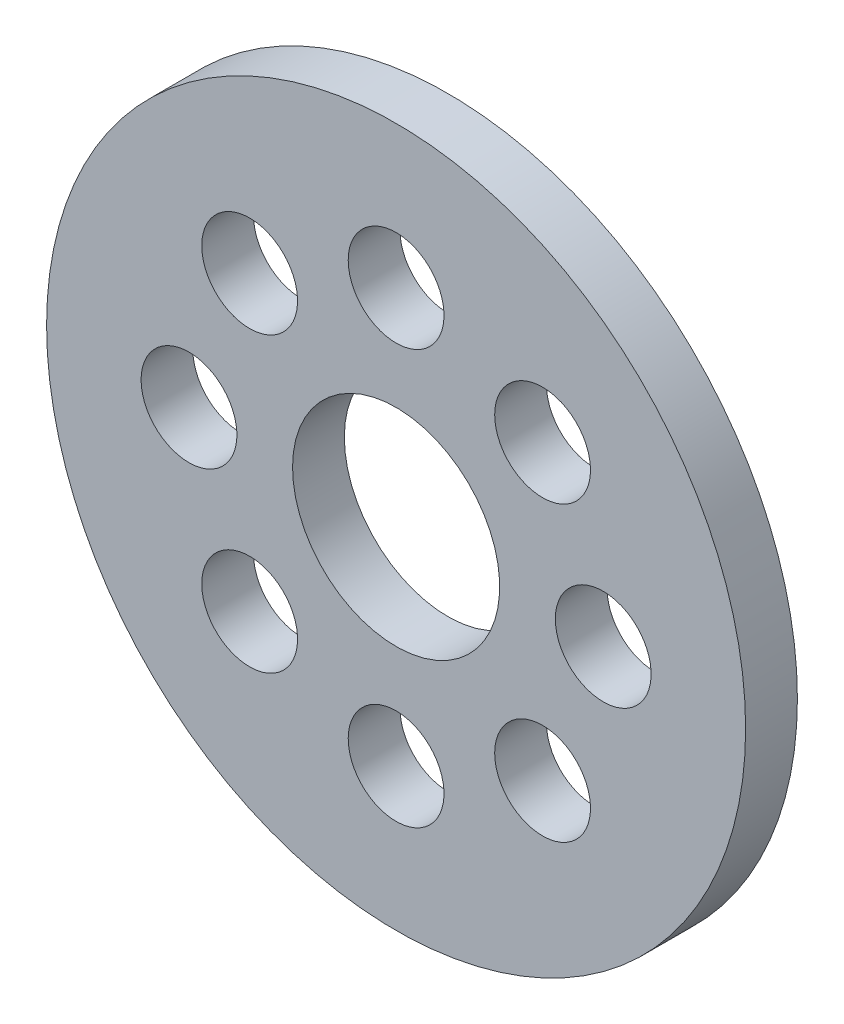
ISO-10303-21;
HEADER;
FILE_DESCRIPTION(('STEP AP214'),'2;1');
FILE_NAME('part.step','',(''),(''),'','','');
FILE_SCHEMA(('AUTOMOTIVE_DESIGN { 1 0 10303 214 1 1 1 1 }'));
ENDSEC;
DATA;
#1=APPLICATION_CONTEXT('core data for automotive mechanical design processes');
#2=APPLICATION_PROTOCOL_DEFINITION('international standard','automotive_design',2000,#1);
#3=PRODUCT_CONTEXT('',#1,'mechanical');
#4=PRODUCT('Part','Part','',(#3));
#5=PRODUCT_RELATED_PRODUCT_CATEGORY('part','',(#4));
#6=PRODUCT_DEFINITION_FORMATION('','',#4);
#7=PRODUCT_DEFINITION_CONTEXT('part definition',#1,'design');
#8=PRODUCT_DEFINITION('design','',#6,#7);
#9=PRODUCT_DEFINITION_SHAPE('','',#8);
#10=(LENGTH_UNIT() NAMED_UNIT(*) SI_UNIT(.MILLI.,.METRE.));
#11=(NAMED_UNIT(*) PLANE_ANGLE_UNIT() SI_UNIT($,.RADIAN.));
#12=(NAMED_UNIT(*) SI_UNIT($,.STERADIAN.) SOLID_ANGLE_UNIT());
#13=UNCERTAINTY_MEASURE_WITH_UNIT(LENGTH_MEASURE(1.E-05),#10,'distance_accuracy_value','');
#14=(GEOMETRIC_REPRESENTATION_CONTEXT(3) GLOBAL_UNCERTAINTY_ASSIGNED_CONTEXT((#13)) GLOBAL_UNIT_ASSIGNED_CONTEXT((#10,
#11,#12)) REPRESENTATION_CONTEXT('',''));
#15=CARTESIAN_POINT('',(0.,0.,0.));
#16=DIRECTION('',(0.,0.,1.));
#17=DIRECTION('',(1.,0.,0.));
#18=AXIS2_PLACEMENT_3D('',#15,#16,#17);
#19=CARTESIAN_POINT('',(0.,0.,0.));
#20=DIRECTION('',(0.,0.,1.));
#21=DIRECTION('',(1.,0.,0.));
#22=AXIS2_PLACEMENT_3D('',#19,#20,#21);
#23=PLANE('',#22);
#24=CARTESIAN_POINT('',(-5.65685424949238,-5.65685424949238,0.));
#25=DIRECTION('',(0.,0.,-1.));
#26=DIRECTION('',(-1.,0.,0.));
#27=AXIS2_PLACEMENT_3D('',#24,#25,#26);
#28=CIRCLE('',#27,1.85);
#29=CARTESIAN_POINT('',(-7.50685424949238,-5.65685424949238,0.));
#30=VERTEX_POINT('',#29);
#31=EDGE_CURVE('E51',#30,#30,#28,.F.);
#32=ORIENTED_EDGE('',*,*,#31,.T.);
#33=EDGE_LOOP('',(#32));
#34=FACE_BOUND('',#33,.T.);
#35=CARTESIAN_POINT('',(5.65685424949238,5.65685424949238,0.));
#36=DIRECTION('',(0.,0.,-1.));
#37=DIRECTION('',(-1.,0.,0.));
#38=AXIS2_PLACEMENT_3D('',#35,#36,#37);
#39=CIRCLE('',#38,1.85);
#40=CARTESIAN_POINT('',(3.80685424949238,5.65685424949238,0.));
#41=VERTEX_POINT('',#40);
#42=EDGE_CURVE('E54',#41,#41,#39,.F.);
#43=ORIENTED_EDGE('',*,*,#42,.T.);
#44=EDGE_LOOP('',(#43));
#45=FACE_BOUND('',#44,.T.);
#46=CARTESIAN_POINT('',(-8.,0.,0.));
#47=DIRECTION('',(0.,0.,-1.));
#48=DIRECTION('',(-1.,0.,0.));
#49=AXIS2_PLACEMENT_3D('',#46,#47,#48);
#50=CIRCLE('',#49,1.85);
#51=CARTESIAN_POINT('',(-9.85,0.,0.));
#52=VERTEX_POINT('',#51);
#53=EDGE_CURVE('E57',#52,#52,#50,.F.);
#54=ORIENTED_EDGE('',*,*,#53,.T.);
#55=EDGE_LOOP('',(#54));
#56=FACE_BOUND('',#55,.T.);
#57=CARTESIAN_POINT('',(8.,0.,0.));
#58=DIRECTION('',(0.,0.,-1.));
#59=DIRECTION('',(-1.,0.,0.));
#60=AXIS2_PLACEMENT_3D('',#57,#58,#59);
#61=CIRCLE('',#60,1.85);
#62=CARTESIAN_POINT('',(6.15,0.,0.));
#63=VERTEX_POINT('',#62);
#64=EDGE_CURVE('E60',#63,#63,#61,.F.);
#65=ORIENTED_EDGE('',*,*,#64,.T.);
#66=EDGE_LOOP('',(#65));
#67=FACE_BOUND('',#66,.T.);
#68=CARTESIAN_POINT('',(0.,0.,0.));
#69=DIRECTION('',(0.,0.,-1.));
#70=DIRECTION('',(-1.,0.,0.));
#71=AXIS2_PLACEMENT_3D('',#68,#69,#70);
#72=CIRCLE('',#71,4.);
#73=CARTESIAN_POINT('',(-4.,0.,0.));
#74=VERTEX_POINT('',#73);
#75=EDGE_CURVE('E63',#74,#74,#72,.F.);
#76=ORIENTED_EDGE('',*,*,#75,.T.);
#77=EDGE_LOOP('',(#76));
#78=FACE_BOUND('',#77,.T.);
#79=CARTESIAN_POINT('',(0.,8.,0.));
#80=DIRECTION('',(0.,0.,-1.));
#81=DIRECTION('',(-1.,0.,0.));
#82=AXIS2_PLACEMENT_3D('',#79,#80,#81);
#83=CIRCLE('',#82,1.85);
#84=CARTESIAN_POINT('',(-1.85,8.,0.));
#85=VERTEX_POINT('',#84);
#86=EDGE_CURVE('E66',#85,#85,#83,.F.);
#87=ORIENTED_EDGE('',*,*,#86,.T.);
#88=EDGE_LOOP('',(#87));
#89=FACE_BOUND('',#88,.T.);
#90=CARTESIAN_POINT('',(0.,-8.,0.));
#91=DIRECTION('',(0.,0.,-1.));
#92=DIRECTION('',(-1.,0.,0.));
#93=AXIS2_PLACEMENT_3D('',#90,#91,#92);
#94=CIRCLE('',#93,1.85);
#95=CARTESIAN_POINT('',(-1.85,-8.,0.));
#96=VERTEX_POINT('',#95);
#97=EDGE_CURVE('E69',#96,#96,#94,.F.);
#98=ORIENTED_EDGE('',*,*,#97,.T.);
#99=EDGE_LOOP('',(#98));
#100=FACE_BOUND('',#99,.T.);
#101=CARTESIAN_POINT('',(-5.65685424949238,5.65685424949238,0.));
#102=DIRECTION('',(0.,0.,-1.));
#103=DIRECTION('',(-1.,0.,0.));
#104=AXIS2_PLACEMENT_3D('',#101,#102,#103);
#105=CIRCLE('',#104,1.85);
#106=CARTESIAN_POINT('',(-7.50685424949238,5.65685424949238,0.));
#107=VERTEX_POINT('',#106);
#108=EDGE_CURVE('E72',#107,#107,#105,.F.);
#109=ORIENTED_EDGE('',*,*,#108,.T.);
#110=EDGE_LOOP('',(#109));
#111=FACE_BOUND('',#110,.T.);
#112=CARTESIAN_POINT('',(5.65685424949238,-5.65685424949238,0.));
#113=DIRECTION('',(0.,0.,-1.));
#114=DIRECTION('',(-1.,0.,0.));
#115=AXIS2_PLACEMENT_3D('',#112,#113,#114);
#116=CIRCLE('',#115,1.85);
#117=CARTESIAN_POINT('',(3.80685424949238,-5.65685424949238,0.));
#118=VERTEX_POINT('',#117);
#119=EDGE_CURVE('E74',#118,#118,#116,.F.);
#120=ORIENTED_EDGE('',*,*,#119,.T.);
#121=EDGE_LOOP('',(#120));
#122=FACE_BOUND('',#121,.T.);
#123=CARTESIAN_POINT('',(0.,0.,0.));
#124=DIRECTION('',(0.,0.,-1.));
#125=DIRECTION('',(-1.,0.,0.));
#126=AXIS2_PLACEMENT_3D('',#123,#124,#125);
#127=CIRCLE('',#126,13.5);
#128=CARTESIAN_POINT('',(-13.5,0.,0.));
#129=VERTEX_POINT('',#128);
#130=EDGE_CURVE('E16',#129,#129,#127,.F.);
#131=ORIENTED_EDGE('',*,*,#130,.F.);
#132=EDGE_LOOP('',(#131));
#133=FACE_BOUND('',#132,.T.);
#134=ADVANCED_FACE('F13',(#34,#45,#56,#67,#78,#89,#100,#111,#122,#133),#23,.F.);
#135=CARTESIAN_POINT('',(0.,0.,2.));
#136=DIRECTION('',(0.,0.,-1.));
#137=DIRECTION('',(-1.,0.,0.));
#138=AXIS2_PLACEMENT_3D('',#135,#136,#137);
#139=CYLINDRICAL_SURFACE('',#138,13.5);
#140=ORIENTED_EDGE('',*,*,#130,.T.);
#141=EDGE_LOOP('',(#140));
#142=FACE_BOUND('',#141,.T.);
#143=CARTESIAN_POINT('',(0.,0.,2.));
#144=DIRECTION('',(0.,0.,-1.));
#145=DIRECTION('',(-1.,0.,0.));
#146=AXIS2_PLACEMENT_3D('',#143,#144,#145);
#147=CIRCLE('',#146,13.5);
#148=CARTESIAN_POINT('',(-13.5,0.,2.));
#149=VERTEX_POINT('',#148);
#150=EDGE_CURVE('E48',#149,#149,#147,.F.);
#151=ORIENTED_EDGE('',*,*,#150,.F.);
#152=EDGE_LOOP('',(#151));
#153=FACE_BOUND('',#152,.T.);
#154=ADVANCED_FACE('F81',(#142,#153),#139,.T.);
#155=CARTESIAN_POINT('',(5.65685424949238,-5.65685424949238,2.));
#156=DIRECTION('',(0.,0.,-1.));
#157=DIRECTION('',(-1.,0.,0.));
#158=AXIS2_PLACEMENT_3D('',#155,#156,#157);
#159=CYLINDRICAL_SURFACE('',#158,1.85);
#160=ORIENTED_EDGE('',*,*,#119,.F.);
#161=EDGE_LOOP('',(#160));
#162=FACE_BOUND('',#161,.T.);
#163=CARTESIAN_POINT('',(5.65685424949238,-5.65685424949238,2.));
#164=DIRECTION('',(0.,0.,-1.));
#165=DIRECTION('',(-1.,0.,0.));
#166=AXIS2_PLACEMENT_3D('',#163,#164,#165);
#167=CIRCLE('',#166,1.85);
#168=CARTESIAN_POINT('',(3.80685424949238,-5.65685424949238,2.));
#169=VERTEX_POINT('',#168);
#170=EDGE_CURVE('E45',#169,#169,#167,.T.);
#171=ORIENTED_EDGE('',*,*,#170,.F.);
#172=EDGE_LOOP('',(#171));
#173=FACE_BOUND('',#172,.T.);
#174=ADVANCED_FACE('F90',(#162,#173),#159,.F.);
#175=CARTESIAN_POINT('',(-5.65685424949238,5.65685424949238,2.));
#176=DIRECTION('',(0.,0.,-1.));
#177=DIRECTION('',(-1.,0.,0.));
#178=AXIS2_PLACEMENT_3D('',#175,#176,#177);
#179=CYLINDRICAL_SURFACE('',#178,1.85);
#180=ORIENTED_EDGE('',*,*,#108,.F.);
#181=EDGE_LOOP('',(#180));
#182=FACE_BOUND('',#181,.T.);
#183=CARTESIAN_POINT('',(-5.65685424949238,5.65685424949238,2.));
#184=DIRECTION('',(0.,0.,-1.));
#185=DIRECTION('',(-1.,0.,0.));
#186=AXIS2_PLACEMENT_3D('',#183,#184,#185);
#187=CIRCLE('',#186,1.85);
#188=CARTESIAN_POINT('',(-7.50685424949238,5.65685424949238,2.));
#189=VERTEX_POINT('',#188);
#190=EDGE_CURVE('E42',#189,#189,#187,.T.);
#191=ORIENTED_EDGE('',*,*,#190,.F.);
#192=EDGE_LOOP('',(#191));
#193=FACE_BOUND('',#192,.T.);
#194=ADVANCED_FACE('F126',(#182,#193),#179,.F.);
#195=CARTESIAN_POINT('',(0.,-8.,2.));
#196=DIRECTION('',(0.,0.,-1.));
#197=DIRECTION('',(-1.,0.,0.));
#198=AXIS2_PLACEMENT_3D('',#195,#196,#197);
#199=CYLINDRICAL_SURFACE('',#198,1.85);
#200=ORIENTED_EDGE('',*,*,#97,.F.);
#201=EDGE_LOOP('',(#200));
#202=FACE_BOUND('',#201,.T.);
#203=CARTESIAN_POINT('',(0.,-8.,2.));
#204=DIRECTION('',(0.,0.,-1.));
#205=DIRECTION('',(-1.,0.,0.));
#206=AXIS2_PLACEMENT_3D('',#203,#204,#205);
#207=CIRCLE('',#206,1.85);
#208=CARTESIAN_POINT('',(-1.85,-8.,2.));
#209=VERTEX_POINT('',#208);
#210=EDGE_CURVE('E39',#209,#209,#207,.T.);
#211=ORIENTED_EDGE('',*,*,#210,.F.);
#212=EDGE_LOOP('',(#211));
#213=FACE_BOUND('',#212,.T.);
#214=ADVANCED_FACE('F122',(#202,#213),#199,.F.);
#215=CARTESIAN_POINT('',(0.,8.,2.));
#216=DIRECTION('',(0.,0.,-1.));
#217=DIRECTION('',(-1.,0.,0.));
#218=AXIS2_PLACEMENT_3D('',#215,#216,#217);
#219=CYLINDRICAL_SURFACE('',#218,1.85);
#220=ORIENTED_EDGE('',*,*,#86,.F.);
#221=EDGE_LOOP('',(#220));
#222=FACE_BOUND('',#221,.T.);
#223=CARTESIAN_POINT('',(0.,8.,2.));
#224=DIRECTION('',(0.,0.,-1.));
#225=DIRECTION('',(-1.,0.,0.));
#226=AXIS2_PLACEMENT_3D('',#223,#224,#225);
#227=CIRCLE('',#226,1.85);
#228=CARTESIAN_POINT('',(-1.85,8.,2.));
#229=VERTEX_POINT('',#228);
#230=EDGE_CURVE('E36',#229,#229,#227,.T.);
#231=ORIENTED_EDGE('',*,*,#230,.F.);
#232=EDGE_LOOP('',(#231));
#233=FACE_BOUND('',#232,.T.);
#234=ADVANCED_FACE('F118',(#222,#233),#219,.F.);
#235=CARTESIAN_POINT('',(0.,0.,2.));
#236=DIRECTION('',(0.,0.,-1.));
#237=DIRECTION('',(-1.,0.,0.));
#238=AXIS2_PLACEMENT_3D('',#235,#236,#237);
#239=CYLINDRICAL_SURFACE('',#238,4.);
#240=ORIENTED_EDGE('',*,*,#75,.F.);
#241=EDGE_LOOP('',(#240));
#242=FACE_BOUND('',#241,.T.);
#243=CARTESIAN_POINT('',(0.,0.,2.));
#244=DIRECTION('',(0.,0.,-1.));
#245=DIRECTION('',(-1.,0.,0.));
#246=AXIS2_PLACEMENT_3D('',#243,#244,#245);
#247=CIRCLE('',#246,4.);
#248=CARTESIAN_POINT('',(-4.,0.,2.));
#249=VERTEX_POINT('',#248);
#250=EDGE_CURVE('E33',#249,#249,#247,.T.);
#251=ORIENTED_EDGE('',*,*,#250,.F.);
#252=EDGE_LOOP('',(#251));
#253=FACE_BOUND('',#252,.T.);
#254=ADVANCED_FACE('F114',(#242,#253),#239,.F.);
#255=CARTESIAN_POINT('',(8.,0.,2.));
#256=DIRECTION('',(0.,0.,-1.));
#257=DIRECTION('',(-1.,0.,0.));
#258=AXIS2_PLACEMENT_3D('',#255,#256,#257);
#259=CYLINDRICAL_SURFACE('',#258,1.85);
#260=ORIENTED_EDGE('',*,*,#64,.F.);
#261=EDGE_LOOP('',(#260));
#262=FACE_BOUND('',#261,.T.);
#263=CARTESIAN_POINT('',(8.,0.,2.));
#264=DIRECTION('',(0.,0.,-1.));
#265=DIRECTION('',(-1.,0.,0.));
#266=AXIS2_PLACEMENT_3D('',#263,#264,#265);
#267=CIRCLE('',#266,1.85);
#268=CARTESIAN_POINT('',(6.15,0.,2.));
#269=VERTEX_POINT('',#268);
#270=EDGE_CURVE('E30',#269,#269,#267,.T.);
#271=ORIENTED_EDGE('',*,*,#270,.F.);
#272=EDGE_LOOP('',(#271));
#273=FACE_BOUND('',#272,.T.);
#274=ADVANCED_FACE('F110',(#262,#273),#259,.F.);
#275=CARTESIAN_POINT('',(-8.,0.,2.));
#276=DIRECTION('',(0.,0.,-1.));
#277=DIRECTION('',(-1.,0.,0.));
#278=AXIS2_PLACEMENT_3D('',#275,#276,#277);
#279=CYLINDRICAL_SURFACE('',#278,1.85);
#280=ORIENTED_EDGE('',*,*,#53,.F.);
#281=EDGE_LOOP('',(#280));
#282=FACE_BOUND('',#281,.T.);
#283=CARTESIAN_POINT('',(-8.,0.,2.));
#284=DIRECTION('',(0.,0.,-1.));
#285=DIRECTION('',(-1.,0.,0.));
#286=AXIS2_PLACEMENT_3D('',#283,#284,#285);
#287=CIRCLE('',#286,1.85);
#288=CARTESIAN_POINT('',(-9.85,0.,2.));
#289=VERTEX_POINT('',#288);
#290=EDGE_CURVE('E25',#289,#289,#287,.T.);
#291=ORIENTED_EDGE('',*,*,#290,.F.);
#292=EDGE_LOOP('',(#291));
#293=FACE_BOUND('',#292,.T.);
#294=ADVANCED_FACE('F106',(#282,#293),#279,.F.);
#295=CARTESIAN_POINT('',(5.65685424949238,5.65685424949238,2.));
#296=DIRECTION('',(0.,0.,-1.));
#297=DIRECTION('',(-1.,0.,0.));
#298=AXIS2_PLACEMENT_3D('',#295,#296,#297);
#299=CYLINDRICAL_SURFACE('',#298,1.85);
#300=ORIENTED_EDGE('',*,*,#42,.F.);
#301=EDGE_LOOP('',(#300));
#302=FACE_BOUND('',#301,.T.);
#303=CARTESIAN_POINT('',(5.65685424949238,5.65685424949238,2.));
#304=DIRECTION('',(0.,0.,-1.));
#305=DIRECTION('',(-1.,0.,0.));
#306=AXIS2_PLACEMENT_3D('',#303,#304,#305);
#307=CIRCLE('',#306,1.85);
#308=CARTESIAN_POINT('',(3.80685424949238,5.65685424949238,2.));
#309=VERTEX_POINT('',#308);
#310=EDGE_CURVE('E20',#309,#309,#307,.T.);
#311=ORIENTED_EDGE('',*,*,#310,.F.);
#312=EDGE_LOOP('',(#311));
#313=FACE_BOUND('',#312,.T.);
#314=ADVANCED_FACE('F99',(#302,#313),#299,.F.);
#315=CARTESIAN_POINT('',(-5.65685424949238,-5.65685424949238,2.));
#316=DIRECTION('',(0.,0.,-1.));
#317=DIRECTION('',(-1.,0.,0.));
#318=AXIS2_PLACEMENT_3D('',#315,#316,#317);
#319=CYLINDRICAL_SURFACE('',#318,1.85);
#320=ORIENTED_EDGE('',*,*,#31,.F.);
#321=EDGE_LOOP('',(#320));
#322=FACE_BOUND('',#321,.T.);
#323=CARTESIAN_POINT('',(-5.65685424949238,-5.65685424949238,2.));
#324=DIRECTION('',(0.,0.,-1.));
#325=DIRECTION('',(-1.,0.,0.));
#326=AXIS2_PLACEMENT_3D('',#323,#324,#325);
#327=CIRCLE('',#326,1.85);
#328=CARTESIAN_POINT('',(-7.50685424949238,-5.65685424949238,2.));
#329=VERTEX_POINT('',#328);
#330=EDGE_CURVE('E9',#329,#329,#327,.T.);
#331=ORIENTED_EDGE('',*,*,#330,.F.);
#332=EDGE_LOOP('',(#331));
#333=FACE_BOUND('',#332,.T.);
#334=ADVANCED_FACE('F94',(#322,#333),#319,.F.);
#335=CARTESIAN_POINT('',(0.,0.,2.));
#336=DIRECTION('',(0.,0.,1.));
#337=DIRECTION('',(1.,0.,0.));
#338=AXIS2_PLACEMENT_3D('',#335,#336,#337);
#339=PLANE('',#338);
#340=ORIENTED_EDGE('',*,*,#330,.T.);
#341=EDGE_LOOP('',(#340));
#342=FACE_BOUND('',#341,.T.);
#343=ORIENTED_EDGE('',*,*,#310,.T.);
#344=EDGE_LOOP('',(#343));
#345=FACE_BOUND('',#344,.T.);
#346=ORIENTED_EDGE('',*,*,#290,.T.);
#347=EDGE_LOOP('',(#346));
#348=FACE_BOUND('',#347,.T.);
#349=ORIENTED_EDGE('',*,*,#270,.T.);
#350=EDGE_LOOP('',(#349));
#351=FACE_BOUND('',#350,.T.);
#352=ORIENTED_EDGE('',*,*,#250,.T.);
#353=EDGE_LOOP('',(#352));
#354=FACE_BOUND('',#353,.T.);
#355=ORIENTED_EDGE('',*,*,#230,.T.);
#356=EDGE_LOOP('',(#355));
#357=FACE_BOUND('',#356,.T.);
#358=ORIENTED_EDGE('',*,*,#210,.T.);
#359=EDGE_LOOP('',(#358));
#360=FACE_BOUND('',#359,.T.);
#361=ORIENTED_EDGE('',*,*,#190,.T.);
#362=EDGE_LOOP('',(#361));
#363=FACE_BOUND('',#362,.T.);
#364=ORIENTED_EDGE('',*,*,#170,.T.);
#365=EDGE_LOOP('',(#364));
#366=FACE_BOUND('',#365,.T.);
#367=ORIENTED_EDGE('',*,*,#150,.T.);
#368=EDGE_LOOP('',(#367));
#369=FACE_BOUND('',#368,.T.);
#370=ADVANCED_FACE('F92',(#342,#345,#348,#351,#354,#357,#360,#363,#366,#369),#339,.T.);
#371=CLOSED_SHELL('',(#134,#154,#174,#194,#214,#234,#254,#274,#294,#314,#334,#370));
#372=MANIFOLD_SOLID_BREP('B1',#371);
#373=ADVANCED_BREP_SHAPE_REPRESENTATION('',(#18,#372),#14);
#374=SHAPE_DEFINITION_REPRESENTATION(#9,#373);
ENDSEC;
END-ISO-10303-21;
